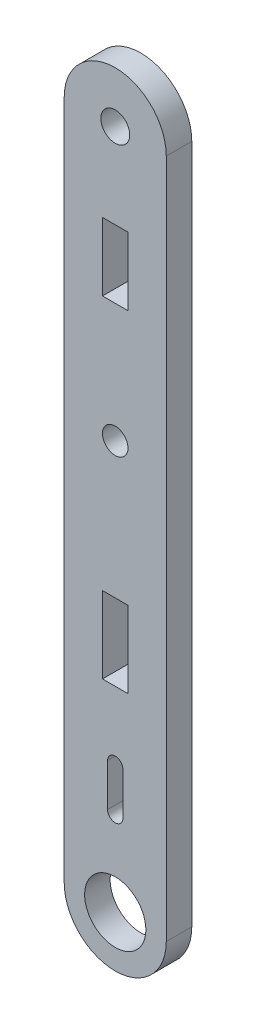
ISO-10303-21;
HEADER;
FILE_DESCRIPTION(('STEP AP214'),'2;1');
FILE_NAME('part.step','',(''),(''),'','','');
FILE_SCHEMA(('AUTOMOTIVE_DESIGN { 1 0 10303 214 1 1 1 1 }'));
ENDSEC;
DATA;
#1=APPLICATION_CONTEXT('core data for automotive mechanical design processes');
#2=APPLICATION_PROTOCOL_DEFINITION('international standard','automotive_design',2000,#1);
#3=PRODUCT_CONTEXT('',#1,'mechanical');
#4=PRODUCT('Part','Part','',(#3));
#5=PRODUCT_RELATED_PRODUCT_CATEGORY('part','',(#4));
#6=PRODUCT_DEFINITION_FORMATION('','',#4);
#7=PRODUCT_DEFINITION_CONTEXT('part definition',#1,'design');
#8=PRODUCT_DEFINITION('design','',#6,#7);
#9=PRODUCT_DEFINITION_SHAPE('','',#8);
#10=(LENGTH_UNIT() NAMED_UNIT(*) SI_UNIT(.MILLI.,.METRE.));
#11=(NAMED_UNIT(*) PLANE_ANGLE_UNIT() SI_UNIT($,.RADIAN.));
#12=(NAMED_UNIT(*) SI_UNIT($,.STERADIAN.) SOLID_ANGLE_UNIT());
#13=UNCERTAINTY_MEASURE_WITH_UNIT(LENGTH_MEASURE(1.E-05),#10,'distance_accuracy_value','');
#14=(GEOMETRIC_REPRESENTATION_CONTEXT(3) GLOBAL_UNCERTAINTY_ASSIGNED_CONTEXT((#13)) GLOBAL_UNIT_ASSIGNED_CONTEXT((#10,
#11,#12)) REPRESENTATION_CONTEXT('',''));
#15=CARTESIAN_POINT('',(0.,0.,0.));
#16=DIRECTION('',(0.,0.,1.));
#17=DIRECTION('',(1.,0.,0.));
#18=AXIS2_PLACEMENT_3D('',#15,#16,#17);
#19=CARTESIAN_POINT('',(33.5190399992291,6.67754878797742,3.));
#20=DIRECTION('',(0.,0.,1.));
#21=DIRECTION('',(1.,0.,0.));
#22=AXIS2_PLACEMENT_3D('',#19,#20,#21);
#23=PLANE('',#22);
#24=CARTESIAN_POINT('',(33.5190399979726,86.677548786721,3.));
#25=DIRECTION('',(0.,0.,1.));
#26=DIRECTION('',(1.,0.,0.));
#27=AXIS2_PLACEMENT_3D('',#24,#25,#26);
#28=CIRCLE('',#27,1.7);
#29=CARTESIAN_POINT('',(35.2190399979726,86.677548786721,3.));
#30=VERTEX_POINT('',#29);
#31=EDGE_CURVE('E251',#30,#30,#28,.T.);
#32=ORIENTED_EDGE('',*,*,#31,.F.);
#33=EDGE_LOOP('',(#32));
#34=FACE_BOUND('',#33,.T.);
#35=CARTESIAN_POINT('',(33.5190399992291,6.67754878797742,3.));
#36=DIRECTION('',(0.,0.,1.));
#37=DIRECTION('',(1.,0.,0.));
#38=AXIS2_PLACEMENT_3D('',#35,#36,#37);
#39=CIRCLE('',#38,5.99999999999994);
#40=CARTESIAN_POINT('',(27.5190399998959,6.67754878862696,3.));
#41=VERTEX_POINT('',#40);
#42=CARTESIAN_POINT('',(39.5190399998958,6.67754878862694,3.));
#43=VERTEX_POINT('',#42);
#44=EDGE_CURVE('E263',#41,#43,#39,.T.);
#45=ORIENTED_EDGE('',*,*,#44,.T.);
#46=DIRECTION('',(0.,1.,0.));
#47=VECTOR('',#46,1.);
#48=CARTESIAN_POINT('',(39.5190399998958,6.67754878862694,3.));
#49=LINE('',#48,#47);
#50=CARTESIAN_POINT('',(39.5190399998958,86.6775487882075,3.));
#51=VERTEX_POINT('',#50);
#52=EDGE_CURVE('E266',#43,#51,#49,.T.);
#53=ORIENTED_EDGE('',*,*,#52,.T.);
#54=CARTESIAN_POINT('',(33.5190399998958,86.6775987884394,3.));
#55=DIRECTION('',(0.,0.,1.));
#56=DIRECTION('',(1.,0.,0.));
#57=AXIS2_PLACEMENT_3D('',#54,#55,#56);
#58=CIRCLE('',#57,6.00000000020827);
#59=CARTESIAN_POINT('',(27.5190399998959,86.6776487886713,3.));
#60=VERTEX_POINT('',#59);
#61=EDGE_CURVE('E269',#51,#60,#58,.T.);
#62=ORIENTED_EDGE('',*,*,#61,.T.);
#63=DIRECTION('',(0.,-1.,0.));
#64=VECTOR('',#63,1.);
#65=CARTESIAN_POINT('',(27.5190399998959,86.6776487886713,3.));
#66=LINE('',#65,#64);
#67=EDGE_CURVE('E271',#60,#41,#66,.T.);
#68=ORIENTED_EDGE('',*,*,#67,.T.);
#69=EDGE_LOOP('',(#45,#53,#62,#68));
#70=FACE_BOUND('',#69,.T.);
#71=CARTESIAN_POINT('',(33.5190399992291,6.67754878797742,3.));
#72=DIRECTION('',(0.,0.,1.));
#73=DIRECTION('',(1.,0.,0.));
#74=AXIS2_PLACEMENT_3D('',#71,#72,#73);
#75=CIRCLE('',#74,3.6);
#76=CARTESIAN_POINT('',(37.1190399992291,6.67754878797742,3.));
#77=VERTEX_POINT('',#76);
#78=EDGE_CURVE('E257',#77,#77,#75,.T.);
#79=ORIENTED_EDGE('',*,*,#78,.F.);
#80=EDGE_LOOP('',(#79));
#81=FACE_BOUND('',#80,.T.);
#82=CARTESIAN_POINT('',(33.5190400015622,54.6776487869774,3.));
#83=DIRECTION('',(0.,0.,1.));
#84=DIRECTION('',(1.,0.,0.));
#85=AXIS2_PLACEMENT_3D('',#82,#83,#84);
#86=CIRCLE('',#85,1.50000000166676);
#87=CARTESIAN_POINT('',(35.019040003229,54.6776487869774,3.));
#88=VERTEX_POINT('',#87);
#89=EDGE_CURVE('E245',#88,#88,#86,.T.);
#90=ORIENTED_EDGE('',*,*,#89,.F.);
#91=EDGE_LOOP('',(#90));
#92=FACE_BOUND('',#91,.T.);
#93=DIRECTION('',(0.,1.,0.));
#94=VECTOR('',#93,1.);
#95=CARTESIAN_POINT('',(34.4190399998957,16.6775487886459,3.));
#96=LINE('',#95,#94);
#97=CARTESIAN_POINT('',(34.4190399998957,16.6775487886459,3.));
#98=VERTEX_POINT('',#97);
#99=CARTESIAN_POINT('',(34.4190399998957,21.6775487858662,3.));
#100=VERTEX_POINT('',#99);
#101=EDGE_CURVE('E216',#98,#100,#96,.T.);
#102=ORIENTED_EDGE('',*,*,#101,.F.);
#103=CARTESIAN_POINT('',(33.5190399998958,16.6775487886459,3.));
#104=DIRECTION('',(0.,0.,1.));
#105=DIRECTION('',(1.,0.,0.));
#106=AXIS2_PLACEMENT_3D('',#103,#104,#105);
#107=CIRCLE('',#106,0.89999999999995);
#108=CARTESIAN_POINT('',(32.6190399998958,16.6775487886459,3.));
#109=VERTEX_POINT('',#108);
#110=EDGE_CURVE('E214',#109,#98,#107,.T.);
#111=ORIENTED_EDGE('',*,*,#110,.F.);
#112=DIRECTION('',(0.,-1.,0.));
#113=VECTOR('',#112,1.);
#114=CARTESIAN_POINT('',(32.6190399998958,21.6776487886438,3.));
#115=LINE('',#114,#113);
#116=CARTESIAN_POINT('',(32.6190399998958,21.6776487886438,3.));
#117=VERTEX_POINT('',#116);
#118=EDGE_CURVE('E222',#117,#109,#115,.T.);
#119=ORIENTED_EDGE('',*,*,#118,.F.);
#120=CARTESIAN_POINT('',(33.5190399998958,21.677598787255,3.));
#121=DIRECTION('',(0.,0.,1.));
#122=DIRECTION('',(1.,0.,0.));
#123=AXIS2_PLACEMENT_3D('',#120,#121,#122);
#124=CIRCLE('',#123,0.900000001388922);
#125=EDGE_CURVE('E219',#100,#117,#124,.T.);
#126=ORIENTED_EDGE('',*,*,#125,.F.);
#127=EDGE_LOOP('',(#102,#111,#119,#126));
#128=FACE_BOUND('',#127,.T.);
#129=DIRECTION('',(0.,1.,0.));
#130=VECTOR('',#129,1.);
#131=CARTESIAN_POINT('',(35.0190399998958,38.6775487886441,3.));
#132=LINE('',#131,#130);
#133=CARTESIAN_POINT('',(35.0190399998958,29.6775487886441,3.));
#134=VERTEX_POINT('',#133);
#135=CARTESIAN_POINT('',(35.0190399998958,38.6775487886441,3.));
#136=VERTEX_POINT('',#135);
#137=EDGE_CURVE('E185',#134,#136,#132,.T.);
#138=ORIENTED_EDGE('',*,*,#137,.F.);
#139=DIRECTION('',(1.,0.,0.));
#140=VECTOR('',#139,1.);
#141=CARTESIAN_POINT('',(35.0190399998958,29.6775487886441,3.));
#142=LINE('',#141,#140);
#143=CARTESIAN_POINT('',(32.0190399998958,29.6775487886441,3.));
#144=VERTEX_POINT('',#143);
#145=EDGE_CURVE('E183',#144,#134,#142,.T.);
#146=ORIENTED_EDGE('',*,*,#145,.F.);
#147=DIRECTION('',(0.,-1.,0.));
#148=VECTOR('',#147,1.);
#149=CARTESIAN_POINT('',(32.0190399998958,29.6775487886441,3.));
#150=LINE('',#149,#148);
#151=CARTESIAN_POINT('',(32.0190399998958,38.6775487886441,3.));
#152=VERTEX_POINT('',#151);
#153=EDGE_CURVE('E191',#152,#144,#150,.T.);
#154=ORIENTED_EDGE('',*,*,#153,.F.);
#155=DIRECTION('',(-1.,0.,0.));
#156=VECTOR('',#155,1.);
#157=CARTESIAN_POINT('',(32.0190399998958,38.6775487886441,3.));
#158=LINE('',#157,#156);
#159=EDGE_CURVE('E188',#136,#152,#158,.T.);
#160=ORIENTED_EDGE('',*,*,#159,.F.);
#161=EDGE_LOOP('',(#138,#146,#154,#160));
#162=FACE_BOUND('',#161,.T.);
#163=DIRECTION('',(0.,-1.,0.));
#164=VECTOR('',#163,1.);
#165=CARTESIAN_POINT('',(32.0190399998958,76.6775487886441,3.));
#166=LINE('',#165,#164);
#167=CARTESIAN_POINT('',(32.0190399998958,76.6775487886441,3.));
#168=VERTEX_POINT('',#167);
#169=CARTESIAN_POINT('',(32.0190399998958,68.6775487886441,3.));
#170=VERTEX_POINT('',#169);
#171=EDGE_CURVE('E155',#168,#170,#166,.T.);
#172=ORIENTED_EDGE('',*,*,#171,.F.);
#173=DIRECTION('',(-1.,0.,0.));
#174=VECTOR('',#173,1.);
#175=CARTESIAN_POINT('',(35.0190399998958,76.6775487886441,3.));
#176=LINE('',#175,#174);
#177=CARTESIAN_POINT('',(35.0190399998958,76.6775487886441,3.));
#178=VERTEX_POINT('',#177);
#179=EDGE_CURVE('E147',#178,#168,#176,.T.);
#180=ORIENTED_EDGE('',*,*,#179,.F.);
#181=DIRECTION('',(0.,1.,0.));
#182=VECTOR('',#181,1.);
#183=CARTESIAN_POINT('',(35.0190399998958,68.6775487886441,3.));
#184=LINE('',#183,#182);
#185=CARTESIAN_POINT('',(35.0190399998958,68.6775487886441,3.));
#186=VERTEX_POINT('',#185);
#187=EDGE_CURVE('E169',#186,#178,#184,.T.);
#188=ORIENTED_EDGE('',*,*,#187,.F.);
#189=DIRECTION('',(1.,0.,0.));
#190=VECTOR('',#189,1.);
#191=CARTESIAN_POINT('',(32.0190399998958,68.6775487886441,3.));
#192=LINE('',#191,#190);
#193=EDGE_CURVE('E167',#170,#186,#192,.T.);
#194=ORIENTED_EDGE('',*,*,#193,.F.);
#195=EDGE_LOOP('',(#172,#180,#188,#194));
#196=FACE_BOUND('',#195,.T.);
#197=ADVANCED_FACE('F34',(#34,#70,#81,#92,#128,#162,#196),#23,.T.);
#198=CARTESIAN_POINT('',(33.5190399992291,6.67754878797742,0.));
#199=DIRECTION('',(0.,0.,1.));
#200=DIRECTION('',(1.,0.,0.));
#201=AXIS2_PLACEMENT_3D('',#198,#199,#200);
#202=PLANE('',#201);
#203=DIRECTION('',(1.,0.,0.));
#204=VECTOR('',#203,1.);
#205=CARTESIAN_POINT('',(35.0190399998958,29.6775487886441,0.));
#206=LINE('',#205,#204);
#207=CARTESIAN_POINT('',(32.0190399998958,29.6775487886441,0.));
#208=VERTEX_POINT('',#207);
#209=CARTESIAN_POINT('',(35.0190399998958,29.6775487886441,0.));
#210=VERTEX_POINT('',#209);
#211=EDGE_CURVE('E163',#208,#210,#206,.T.);
#212=ORIENTED_EDGE('',*,*,#211,.T.);
#213=DIRECTION('',(0.,1.,0.));
#214=VECTOR('',#213,1.);
#215=CARTESIAN_POINT('',(35.0190399998958,38.6775487886441,0.));
#216=LINE('',#215,#214);
#217=CARTESIAN_POINT('',(35.0190399998958,38.6775487886441,0.));
#218=VERTEX_POINT('',#217);
#219=EDGE_CURVE('E196',#210,#218,#216,.T.);
#220=ORIENTED_EDGE('',*,*,#219,.T.);
#221=DIRECTION('',(-1.,0.,0.));
#222=VECTOR('',#221,1.);
#223=CARTESIAN_POINT('',(32.0190399998958,38.6775487886441,0.));
#224=LINE('',#223,#222);
#225=CARTESIAN_POINT('',(32.0190399998958,38.6775487886441,0.));
#226=VERTEX_POINT('',#225);
#227=EDGE_CURVE('E199',#218,#226,#224,.T.);
#228=ORIENTED_EDGE('',*,*,#227,.T.);
#229=DIRECTION('',(0.,-1.,0.));
#230=VECTOR('',#229,1.);
#231=CARTESIAN_POINT('',(32.0190399998958,29.6775487886441,0.));
#232=LINE('',#231,#230);
#233=EDGE_CURVE('E186',#226,#208,#232,.T.);
#234=ORIENTED_EDGE('',*,*,#233,.T.);
#235=EDGE_LOOP('',(#212,#220,#228,#234));
#236=FACE_BOUND('',#235,.T.);
#237=CARTESIAN_POINT('',(33.5190400015622,54.6776487869774,0.));
#238=DIRECTION('',(0.,0.,1.));
#239=DIRECTION('',(1.,0.,0.));
#240=AXIS2_PLACEMENT_3D('',#237,#238,#239);
#241=CIRCLE('',#240,1.50000000166676);
#242=CARTESIAN_POINT('',(35.019040003229,54.6776487869774,0.));
#243=VERTEX_POINT('',#242);
#244=EDGE_CURVE('E244',#243,#243,#241,.T.);
#245=ORIENTED_EDGE('',*,*,#244,.T.);
#246=EDGE_LOOP('',(#245));
#247=FACE_BOUND('',#246,.T.);
#248=CARTESIAN_POINT('',(33.5190399979726,86.677548786721,0.));
#249=DIRECTION('',(0.,0.,1.));
#250=DIRECTION('',(1.,0.,0.));
#251=AXIS2_PLACEMENT_3D('',#248,#249,#250);
#252=CIRCLE('',#251,1.7);
#253=CARTESIAN_POINT('',(35.2190399979726,86.677548786721,0.));
#254=VERTEX_POINT('',#253);
#255=EDGE_CURVE('E248',#254,#254,#252,.T.);
#256=ORIENTED_EDGE('',*,*,#255,.T.);
#257=EDGE_LOOP('',(#256));
#258=FACE_BOUND('',#257,.T.);
#259=CARTESIAN_POINT('',(33.5190399992291,6.67754878797742,0.));
#260=DIRECTION('',(0.,0.,1.));
#261=DIRECTION('',(1.,0.,0.));
#262=AXIS2_PLACEMENT_3D('',#259,#260,#261);
#263=CIRCLE('',#262,3.6);
#264=CARTESIAN_POINT('',(37.1190399992291,6.67754878797742,0.));
#265=VERTEX_POINT('',#264);
#266=EDGE_CURVE('E254',#265,#265,#263,.T.);
#267=ORIENTED_EDGE('',*,*,#266,.T.);
#268=EDGE_LOOP('',(#267));
#269=FACE_BOUND('',#268,.T.);
#270=CARTESIAN_POINT('',(33.5190399992291,6.67754878797742,0.));
#271=DIRECTION('',(0.,0.,1.));
#272=DIRECTION('',(1.,0.,0.));
#273=AXIS2_PLACEMENT_3D('',#270,#271,#272);
#274=CIRCLE('',#273,5.99999999999994);
#275=CARTESIAN_POINT('',(27.5190399998959,6.67754878862696,0.));
#276=VERTEX_POINT('',#275);
#277=CARTESIAN_POINT('',(39.5190399998958,6.67754878862694,0.));
#278=VERTEX_POINT('',#277);
#279=EDGE_CURVE('E260',#276,#278,#274,.T.);
#280=ORIENTED_EDGE('',*,*,#279,.F.);
#281=DIRECTION('',(0.,-1.,0.));
#282=VECTOR('',#281,1.);
#283=CARTESIAN_POINT('',(27.5190399998959,86.6776487886713,0.));
#284=LINE('',#283,#282);
#285=CARTESIAN_POINT('',(27.5190399998959,86.6776487886713,0.));
#286=VERTEX_POINT('',#285);
#287=EDGE_CURVE('E267',#286,#276,#284,.T.);
#288=ORIENTED_EDGE('',*,*,#287,.F.);
#289=CARTESIAN_POINT('',(33.5190399998958,86.6775987884394,0.));
#290=DIRECTION('',(0.,0.,1.));
#291=DIRECTION('',(1.,0.,0.));
#292=AXIS2_PLACEMENT_3D('',#289,#290,#291);
#293=CIRCLE('',#292,6.00000000020827);
#294=CARTESIAN_POINT('',(39.5190399998958,86.6775487882075,0.));
#295=VERTEX_POINT('',#294);
#296=EDGE_CURVE('E278',#295,#286,#293,.T.);
#297=ORIENTED_EDGE('',*,*,#296,.F.);
#298=DIRECTION('',(0.,1.,0.));
#299=VECTOR('',#298,1.);
#300=CARTESIAN_POINT('',(39.5190399998958,75.7731023358865,0.));
#301=LINE('',#300,#299);
#302=EDGE_CURVE('E276',#278,#295,#301,.T.);
#303=ORIENTED_EDGE('',*,*,#302,.F.);
#304=EDGE_LOOP('',(#280,#288,#297,#303));
#305=FACE_BOUND('',#304,.T.);
#306=CARTESIAN_POINT('',(33.5190399998958,16.6775487886459,0.));
#307=DIRECTION('',(0.,0.,1.));
#308=DIRECTION('',(1.,0.,0.));
#309=AXIS2_PLACEMENT_3D('',#306,#307,#308);
#310=CIRCLE('',#309,0.89999999999995);
#311=CARTESIAN_POINT('',(32.6190399998958,16.6775487886459,0.));
#312=VERTEX_POINT('',#311);
#313=CARTESIAN_POINT('',(34.4190399998957,16.6775487886459,0.));
#314=VERTEX_POINT('',#313);
#315=EDGE_CURVE('E213',#312,#314,#310,.T.);
#316=ORIENTED_EDGE('',*,*,#315,.T.);
#317=DIRECTION('',(0.,1.,0.));
#318=VECTOR('',#317,1.);
#319=CARTESIAN_POINT('',(34.4190399998957,16.6775487886459,0.));
#320=LINE('',#319,#318);
#321=CARTESIAN_POINT('',(34.4190399998957,21.6775487858662,0.));
#322=VERTEX_POINT('',#321);
#323=EDGE_CURVE('E227',#314,#322,#320,.T.);
#324=ORIENTED_EDGE('',*,*,#323,.T.);
#325=CARTESIAN_POINT('',(33.5190399998958,21.677598787255,0.));
#326=DIRECTION('',(0.,0.,1.));
#327=DIRECTION('',(1.,0.,0.));
#328=AXIS2_PLACEMENT_3D('',#325,#326,#327);
#329=CIRCLE('',#328,0.900000001388922);
#330=CARTESIAN_POINT('',(32.6190399998958,21.6776487886438,0.));
#331=VERTEX_POINT('',#330);
#332=EDGE_CURVE('E230',#322,#331,#329,.T.);
#333=ORIENTED_EDGE('',*,*,#332,.T.);
#334=DIRECTION('',(0.,-1.,0.));
#335=VECTOR('',#334,1.);
#336=CARTESIAN_POINT('',(32.6190399998958,21.6776487886438,0.));
#337=LINE('',#336,#335);
#338=EDGE_CURVE('E217',#331,#312,#337,.T.);
#339=ORIENTED_EDGE('',*,*,#338,.T.);
#340=EDGE_LOOP('',(#316,#324,#333,#339));
#341=FACE_BOUND('',#340,.T.);
#342=DIRECTION('',(-1.,0.,0.));
#343=VECTOR('',#342,1.);
#344=CARTESIAN_POINT('',(35.0190399998958,76.6775487886441,0.));
#345=LINE('',#344,#343);
#346=CARTESIAN_POINT('',(35.0190399998958,76.6775487886441,0.));
#347=VERTEX_POINT('',#346);
#348=CARTESIAN_POINT('',(32.0190399998958,76.6775487886441,0.));
#349=VERTEX_POINT('',#348);
#350=EDGE_CURVE('E57',#347,#349,#345,.T.);
#351=ORIENTED_EDGE('',*,*,#350,.T.);
#352=DIRECTION('',(0.,-1.,0.));
#353=VECTOR('',#352,1.);
#354=CARTESIAN_POINT('',(32.0190399998958,76.6775487886441,0.));
#355=LINE('',#354,#353);
#356=CARTESIAN_POINT('',(32.0190399998958,68.6775487886441,0.));
#357=VERTEX_POINT('',#356);
#358=EDGE_CURVE('E162',#349,#357,#355,.T.);
#359=ORIENTED_EDGE('',*,*,#358,.T.);
#360=DIRECTION('',(1.,0.,0.));
#361=VECTOR('',#360,1.);
#362=CARTESIAN_POINT('',(32.0190399998958,68.6775487886441,0.));
#363=LINE('',#362,#361);
#364=CARTESIAN_POINT('',(35.0190399998958,68.6775487886441,0.));
#365=VERTEX_POINT('',#364);
#366=EDGE_CURVE('E175',#357,#365,#363,.T.);
#367=ORIENTED_EDGE('',*,*,#366,.T.);
#368=DIRECTION('',(0.,1.,0.));
#369=VECTOR('',#368,1.);
#370=CARTESIAN_POINT('',(35.0190399998958,68.6775487886441,0.));
#371=LINE('',#370,#369);
#372=EDGE_CURVE('E156',#365,#347,#371,.T.);
#373=ORIENTED_EDGE('',*,*,#372,.T.);
#374=EDGE_LOOP('',(#351,#359,#367,#373));
#375=FACE_BOUND('',#374,.T.);
#376=ADVANCED_FACE('F296',(#236,#247,#258,#269,#305,#341,#375),#202,.F.);
#377=CARTESIAN_POINT('',(33.5190399992291,6.67754878797742,3.));
#378=DIRECTION('',(0.,0.,-1.));
#379=DIRECTION('',(-1.,0.,0.));
#380=AXIS2_PLACEMENT_3D('',#377,#378,#379);
#381=CYLINDRICAL_SURFACE('',#380,5.99999999999994);
#382=ORIENTED_EDGE('',*,*,#279,.T.);
#383=DIRECTION('',(0.,0.,-1.));
#384=VECTOR('',#383,1.);
#385=CARTESIAN_POINT('',(39.5190399998958,6.67754878862694,3.));
#386=LINE('',#385,#384);
#387=EDGE_CURVE('E11',#43,#278,#386,.T.);
#388=ORIENTED_EDGE('',*,*,#387,.F.);
#389=ORIENTED_EDGE('',*,*,#44,.F.);
#390=DIRECTION('',(0.,0.,-1.));
#391=VECTOR('',#390,1.);
#392=CARTESIAN_POINT('',(27.5190399998959,6.67754878862696,3.));
#393=LINE('',#392,#391);
#394=EDGE_CURVE('E273',#41,#276,#393,.T.);
#395=ORIENTED_EDGE('',*,*,#394,.T.);
#396=EDGE_LOOP('',(#382,#388,#389,#395));
#397=FACE_BOUND('',#396,.T.);
#398=ADVANCED_FACE('F36',(#397),#381,.T.);
#399=CARTESIAN_POINT('',(39.5190399998958,75.7731023358865,3.));
#400=DIRECTION('',(-1.,0.,0.));
#401=DIRECTION('',(0.,-1.,0.));
#402=AXIS2_PLACEMENT_3D('',#399,#400,#401);
#403=PLANE('',#402);
#404=ORIENTED_EDGE('',*,*,#302,.T.);
#405=DIRECTION('',(0.,0.,-1.));
#406=VECTOR('',#405,1.);
#407=CARTESIAN_POINT('',(39.5190399998958,86.6775487882075,3.));
#408=LINE('',#407,#406);
#409=EDGE_CURVE('E42',#51,#295,#408,.T.);
#410=ORIENTED_EDGE('',*,*,#409,.F.);
#411=ORIENTED_EDGE('',*,*,#52,.F.);
#412=ORIENTED_EDGE('',*,*,#387,.T.);
#413=EDGE_LOOP('',(#404,#410,#411,#412));
#414=FACE_BOUND('',#413,.T.);
#415=ADVANCED_FACE('F307',(#414),#403,.F.);
#416=CARTESIAN_POINT('',(33.5190399998958,86.6775987884394,3.));
#417=DIRECTION('',(0.,0.,-1.));
#418=DIRECTION('',(-1.,0.,0.));
#419=AXIS2_PLACEMENT_3D('',#416,#417,#418);
#420=CYLINDRICAL_SURFACE('',#419,6.00000000020827);
#421=ORIENTED_EDGE('',*,*,#296,.T.);
#422=DIRECTION('',(0.,0.,-1.));
#423=VECTOR('',#422,1.);
#424=CARTESIAN_POINT('',(27.5190399998959,86.6776487886713,3.));
#425=LINE('',#424,#423);
#426=EDGE_CURVE('E283',#60,#286,#425,.T.);
#427=ORIENTED_EDGE('',*,*,#426,.F.);
#428=ORIENTED_EDGE('',*,*,#61,.F.);
#429=ORIENTED_EDGE('',*,*,#409,.T.);
#430=EDGE_LOOP('',(#421,#427,#428,#429));
#431=FACE_BOUND('',#430,.T.);
#432=ADVANCED_FACE('F290',(#431),#420,.T.);
#433=CARTESIAN_POINT('',(27.5190399998959,86.6776487886713,3.));
#434=DIRECTION('',(1.,0.,0.));
#435=DIRECTION('',(0.,1.,0.));
#436=AXIS2_PLACEMENT_3D('',#433,#434,#435);
#437=PLANE('',#436);
#438=ORIENTED_EDGE('',*,*,#287,.T.);
#439=ORIENTED_EDGE('',*,*,#394,.F.);
#440=ORIENTED_EDGE('',*,*,#67,.F.);
#441=ORIENTED_EDGE('',*,*,#426,.T.);
#442=EDGE_LOOP('',(#438,#439,#440,#441));
#443=FACE_BOUND('',#442,.T.);
#444=ADVANCED_FACE('F300',(#443),#437,.F.);
#445=CARTESIAN_POINT('',(33.5190399992291,6.67754878797742,3.));
#446=DIRECTION('',(0.,0.,-1.));
#447=DIRECTION('',(-1.,0.,0.));
#448=AXIS2_PLACEMENT_3D('',#445,#446,#447);
#449=CYLINDRICAL_SURFACE('',#448,3.6);
#450=ORIENTED_EDGE('',*,*,#78,.T.);
#451=EDGE_LOOP('',(#450));
#452=FACE_BOUND('',#451,.T.);
#453=ORIENTED_EDGE('',*,*,#266,.F.);
#454=EDGE_LOOP('',(#453));
#455=FACE_BOUND('',#454,.T.);
#456=ADVANCED_FACE('F324',(#452,#455),#449,.F.);
#457=CARTESIAN_POINT('',(33.5190399979726,86.677548786721,3.));
#458=DIRECTION('',(0.,0.,-1.));
#459=DIRECTION('',(-1.,0.,0.));
#460=AXIS2_PLACEMENT_3D('',#457,#458,#459);
#461=CYLINDRICAL_SURFACE('',#460,1.7);
#462=ORIENTED_EDGE('',*,*,#31,.T.);
#463=EDGE_LOOP('',(#462));
#464=FACE_BOUND('',#463,.T.);
#465=ORIENTED_EDGE('',*,*,#255,.F.);
#466=EDGE_LOOP('',(#465));
#467=FACE_BOUND('',#466,.T.);
#468=ADVANCED_FACE('F331',(#464,#467),#461,.F.);
#469=CARTESIAN_POINT('',(33.5190400015622,54.6776487869774,3.));
#470=DIRECTION('',(0.,0.,-1.));
#471=DIRECTION('',(-1.,0.,0.));
#472=AXIS2_PLACEMENT_3D('',#469,#470,#471);
#473=CYLINDRICAL_SURFACE('',#472,1.50000000166676);
#474=ORIENTED_EDGE('',*,*,#89,.T.);
#475=EDGE_LOOP('',(#474));
#476=FACE_BOUND('',#475,.T.);
#477=ORIENTED_EDGE('',*,*,#244,.F.);
#478=EDGE_LOOP('',(#477));
#479=FACE_BOUND('',#478,.T.);
#480=ADVANCED_FACE('F336',(#476,#479),#473,.F.);
#481=CARTESIAN_POINT('',(33.5190399998958,16.6775487886459,3.));
#482=DIRECTION('',(0.,0.,-1.));
#483=DIRECTION('',(-1.,0.,0.));
#484=AXIS2_PLACEMENT_3D('',#481,#482,#483);
#485=CYLINDRICAL_SURFACE('',#484,0.89999999999995);
#486=ORIENTED_EDGE('',*,*,#315,.F.);
#487=DIRECTION('',(0.,0.,-1.));
#488=VECTOR('',#487,1.);
#489=CARTESIAN_POINT('',(32.6190399998958,16.6775487886459,3.));
#490=LINE('',#489,#488);
#491=EDGE_CURVE('E224',#109,#312,#490,.T.);
#492=ORIENTED_EDGE('',*,*,#491,.F.);
#493=ORIENTED_EDGE('',*,*,#110,.T.);
#494=DIRECTION('',(0.,0.,-1.));
#495=VECTOR('',#494,1.);
#496=CARTESIAN_POINT('',(34.4190399998957,16.6775487886459,3.));
#497=LINE('',#496,#495);
#498=EDGE_CURVE('E241',#98,#314,#497,.T.);
#499=ORIENTED_EDGE('',*,*,#498,.T.);
#500=EDGE_LOOP('',(#486,#492,#493,#499));
#501=FACE_BOUND('',#500,.T.);
#502=ADVANCED_FACE('F392',(#501),#485,.F.);
#503=CARTESIAN_POINT('',(34.4190399998957,16.6775487886459,3.));
#504=DIRECTION('',(-1.,0.,0.));
#505=DIRECTION('',(0.,0.,1.));
#506=AXIS2_PLACEMENT_3D('',#503,#504,#505);
#507=PLANE('',#506);
#508=ORIENTED_EDGE('',*,*,#323,.F.);
#509=ORIENTED_EDGE('',*,*,#498,.F.);
#510=ORIENTED_EDGE('',*,*,#101,.T.);
#511=DIRECTION('',(0.,0.,-1.));
#512=VECTOR('',#511,1.);
#513=CARTESIAN_POINT('',(34.4190399998957,21.6775487858662,3.));
#514=LINE('',#513,#512);
#515=EDGE_CURVE('E239',#100,#322,#514,.T.);
#516=ORIENTED_EDGE('',*,*,#515,.T.);
#517=EDGE_LOOP('',(#508,#509,#510,#516));
#518=FACE_BOUND('',#517,.T.);
#519=ADVANCED_FACE('F388',(#518),#507,.T.);
#520=CARTESIAN_POINT('',(33.5190399998958,21.677598787255,3.));
#521=DIRECTION('',(0.,0.,-1.));
#522=DIRECTION('',(-1.,0.,0.));
#523=AXIS2_PLACEMENT_3D('',#520,#521,#522);
#524=CYLINDRICAL_SURFACE('',#523,0.900000001388922);
#525=ORIENTED_EDGE('',*,*,#332,.F.);
#526=ORIENTED_EDGE('',*,*,#515,.F.);
#527=ORIENTED_EDGE('',*,*,#125,.T.);
#528=DIRECTION('',(0.,0.,-1.));
#529=VECTOR('',#528,1.);
#530=CARTESIAN_POINT('',(32.6190399998958,21.6776487886438,3.));
#531=LINE('',#530,#529);
#532=EDGE_CURVE('E237',#117,#331,#531,.T.);
#533=ORIENTED_EDGE('',*,*,#532,.T.);
#534=EDGE_LOOP('',(#525,#526,#527,#533));
#535=FACE_BOUND('',#534,.T.);
#536=ADVANCED_FACE('F384',(#535),#524,.F.);
#537=CARTESIAN_POINT('',(32.6190399998958,21.6776487886438,3.));
#538=DIRECTION('',(1.,0.,0.));
#539=DIRECTION('',(0.,1.,0.));
#540=AXIS2_PLACEMENT_3D('',#537,#538,#539);
#541=PLANE('',#540);
#542=ORIENTED_EDGE('',*,*,#338,.F.);
#543=ORIENTED_EDGE('',*,*,#532,.F.);
#544=ORIENTED_EDGE('',*,*,#118,.T.);
#545=ORIENTED_EDGE('',*,*,#491,.T.);
#546=EDGE_LOOP('',(#542,#543,#544,#545));
#547=FACE_BOUND('',#546,.T.);
#548=ADVANCED_FACE('F381',(#547),#541,.T.);
#549=CARTESIAN_POINT('',(35.0190399998958,29.6775487886441,3.));
#550=DIRECTION('',(0.,1.,0.));
#551=DIRECTION('',(-1.,0.,0.));
#552=AXIS2_PLACEMENT_3D('',#549,#550,#551);
#553=PLANE('',#552);
#554=ORIENTED_EDGE('',*,*,#211,.F.);
#555=DIRECTION('',(0.,0.,-1.));
#556=VECTOR('',#555,1.);
#557=CARTESIAN_POINT('',(32.0190399998958,29.6775487886441,3.));
#558=LINE('',#557,#556);
#559=EDGE_CURVE('E193',#144,#208,#558,.T.);
#560=ORIENTED_EDGE('',*,*,#559,.F.);
#561=ORIENTED_EDGE('',*,*,#145,.T.);
#562=DIRECTION('',(0.,0.,-1.));
#563=VECTOR('',#562,1.);
#564=CARTESIAN_POINT('',(35.0190399998958,29.6775487886441,3.));
#565=LINE('',#564,#563);
#566=EDGE_CURVE('E210',#134,#210,#565,.T.);
#567=ORIENTED_EDGE('',*,*,#566,.T.);
#568=EDGE_LOOP('',(#554,#560,#561,#567));
#569=FACE_BOUND('',#568,.T.);
#570=ADVANCED_FACE('F363',(#569),#553,.T.);
#571=CARTESIAN_POINT('',(35.0190399998958,38.6775487886441,3.));
#572=DIRECTION('',(-1.,0.,0.));
#573=DIRECTION('',(0.,0.,1.));
#574=AXIS2_PLACEMENT_3D('',#571,#572,#573);
#575=PLANE('',#574);
#576=ORIENTED_EDGE('',*,*,#219,.F.);
#577=ORIENTED_EDGE('',*,*,#566,.F.);
#578=ORIENTED_EDGE('',*,*,#137,.T.);
#579=DIRECTION('',(0.,0.,-1.));
#580=VECTOR('',#579,1.);
#581=CARTESIAN_POINT('',(35.0190399998958,38.6775487886441,3.));
#582=LINE('',#581,#580);
#583=EDGE_CURVE('E208',#136,#218,#582,.T.);
#584=ORIENTED_EDGE('',*,*,#583,.T.);
#585=EDGE_LOOP('',(#576,#577,#578,#584));
#586=FACE_BOUND('',#585,.T.);
#587=ADVANCED_FACE('F356',(#586),#575,.T.);
#588=CARTESIAN_POINT('',(32.0190399998958,38.6775487886441,3.));
#589=DIRECTION('',(0.,-1.,0.));
#590=DIRECTION('',(1.,0.,0.));
#591=AXIS2_PLACEMENT_3D('',#588,#589,#590);
#592=PLANE('',#591);
#593=ORIENTED_EDGE('',*,*,#227,.F.);
#594=ORIENTED_EDGE('',*,*,#583,.F.);
#595=ORIENTED_EDGE('',*,*,#159,.T.);
#596=DIRECTION('',(0.,0.,-1.));
#597=VECTOR('',#596,1.);
#598=CARTESIAN_POINT('',(32.0190399998958,38.6775487886441,3.));
#599=LINE('',#598,#597);
#600=EDGE_CURVE('E206',#152,#226,#599,.T.);
#601=ORIENTED_EDGE('',*,*,#600,.T.);
#602=EDGE_LOOP('',(#593,#594,#595,#601));
#603=FACE_BOUND('',#602,.T.);
#604=ADVANCED_FACE('F359',(#603),#592,.T.);
#605=CARTESIAN_POINT('',(32.0190399998958,29.6775487886441,3.));
#606=DIRECTION('',(1.,0.,0.));
#607=DIRECTION('',(0.,0.,-1.));
#608=AXIS2_PLACEMENT_3D('',#605,#606,#607);
#609=PLANE('',#608);
#610=ORIENTED_EDGE('',*,*,#233,.F.);
#611=ORIENTED_EDGE('',*,*,#600,.F.);
#612=ORIENTED_EDGE('',*,*,#153,.T.);
#613=ORIENTED_EDGE('',*,*,#559,.T.);
#614=EDGE_LOOP('',(#610,#611,#612,#613));
#615=FACE_BOUND('',#614,.T.);
#616=ADVANCED_FACE('F366',(#615),#609,.T.);
#617=CARTESIAN_POINT('',(35.0190399998958,76.6775487886441,3.));
#618=DIRECTION('',(0.,-1.,0.));
#619=DIRECTION('',(0.,0.,-1.));
#620=AXIS2_PLACEMENT_3D('',#617,#618,#619);
#621=PLANE('',#620);
#622=ORIENTED_EDGE('',*,*,#350,.F.);
#623=DIRECTION('',(0.,0.,-1.));
#624=VECTOR('',#623,1.);
#625=CARTESIAN_POINT('',(35.0190399998958,76.6775487886441,3.));
#626=LINE('',#625,#624);
#627=EDGE_CURVE('E151',#178,#347,#626,.T.);
#628=ORIENTED_EDGE('',*,*,#627,.F.);
#629=ORIENTED_EDGE('',*,*,#179,.T.);
#630=DIRECTION('',(0.,0.,-1.));
#631=VECTOR('',#630,1.);
#632=CARTESIAN_POINT('',(32.0190399998958,76.6775487886441,3.));
#633=LINE('',#632,#631);
#634=EDGE_CURVE('E150',#168,#349,#633,.T.);
#635=ORIENTED_EDGE('',*,*,#634,.T.);
#636=EDGE_LOOP('',(#622,#628,#629,#635));
#637=FACE_BOUND('',#636,.T.);
#638=ADVANCED_FACE('F149',(#637),#621,.T.);
#639=CARTESIAN_POINT('',(32.0190399998958,76.6775487886441,3.));
#640=DIRECTION('',(1.,0.,0.));
#641=DIRECTION('',(0.,0.,-1.));
#642=AXIS2_PLACEMENT_3D('',#639,#640,#641);
#643=PLANE('',#642);
#644=ORIENTED_EDGE('',*,*,#358,.F.);
#645=ORIENTED_EDGE('',*,*,#634,.F.);
#646=ORIENTED_EDGE('',*,*,#171,.T.);
#647=DIRECTION('',(0.,0.,-1.));
#648=VECTOR('',#647,1.);
#649=CARTESIAN_POINT('',(32.0190399998958,68.6775487886441,3.));
#650=LINE('',#649,#648);
#651=EDGE_CURVE('E164',#170,#357,#650,.T.);
#652=ORIENTED_EDGE('',*,*,#651,.T.);
#653=EDGE_LOOP('',(#644,#645,#646,#652));
#654=FACE_BOUND('',#653,.T.);
#655=ADVANCED_FACE('F159',(#654),#643,.T.);
#656=CARTESIAN_POINT('',(32.0190399998958,68.6775487886441,3.));
#657=DIRECTION('',(0.,1.,0.));
#658=DIRECTION('',(0.,0.,1.));
#659=AXIS2_PLACEMENT_3D('',#656,#657,#658);
#660=PLANE('',#659);
#661=ORIENTED_EDGE('',*,*,#366,.F.);
#662=ORIENTED_EDGE('',*,*,#651,.F.);
#663=ORIENTED_EDGE('',*,*,#193,.T.);
#664=DIRECTION('',(0.,0.,-1.));
#665=VECTOR('',#664,1.);
#666=CARTESIAN_POINT('',(35.0190399998958,68.6775487886441,3.));
#667=LINE('',#666,#665);
#668=EDGE_CURVE('E49',#186,#365,#667,.T.);
#669=ORIENTED_EDGE('',*,*,#668,.T.);
#670=EDGE_LOOP('',(#661,#662,#663,#669));
#671=FACE_BOUND('',#670,.T.);
#672=ADVANCED_FACE('F455',(#671),#660,.T.);
#673=CARTESIAN_POINT('',(35.0190399998958,68.6775487886441,3.));
#674=DIRECTION('',(-1.,0.,0.));
#675=DIRECTION('',(0.,0.,1.));
#676=AXIS2_PLACEMENT_3D('',#673,#674,#675);
#677=PLANE('',#676);
#678=ORIENTED_EDGE('',*,*,#372,.F.);
#679=ORIENTED_EDGE('',*,*,#668,.F.);
#680=ORIENTED_EDGE('',*,*,#187,.T.);
#681=ORIENTED_EDGE('',*,*,#627,.T.);
#682=EDGE_LOOP('',(#678,#679,#680,#681));
#683=FACE_BOUND('',#682,.T.);
#684=ADVANCED_FACE('F463',(#683),#677,.T.);
#685=CLOSED_SHELL('',(#197,#376,#398,#415,#432,#444,#456,#468,#480,#502,#519,#536,#548,#570,
#587,#604,#616,#638,#655,#672,#684));
#686=MANIFOLD_SOLID_BREP('B2',#685);
#687=ADVANCED_BREP_SHAPE_REPRESENTATION('',(#18,#686),#14);
#688=SHAPE_DEFINITION_REPRESENTATION(#9,#687);
ENDSEC;
END-ISO-10303-21;
